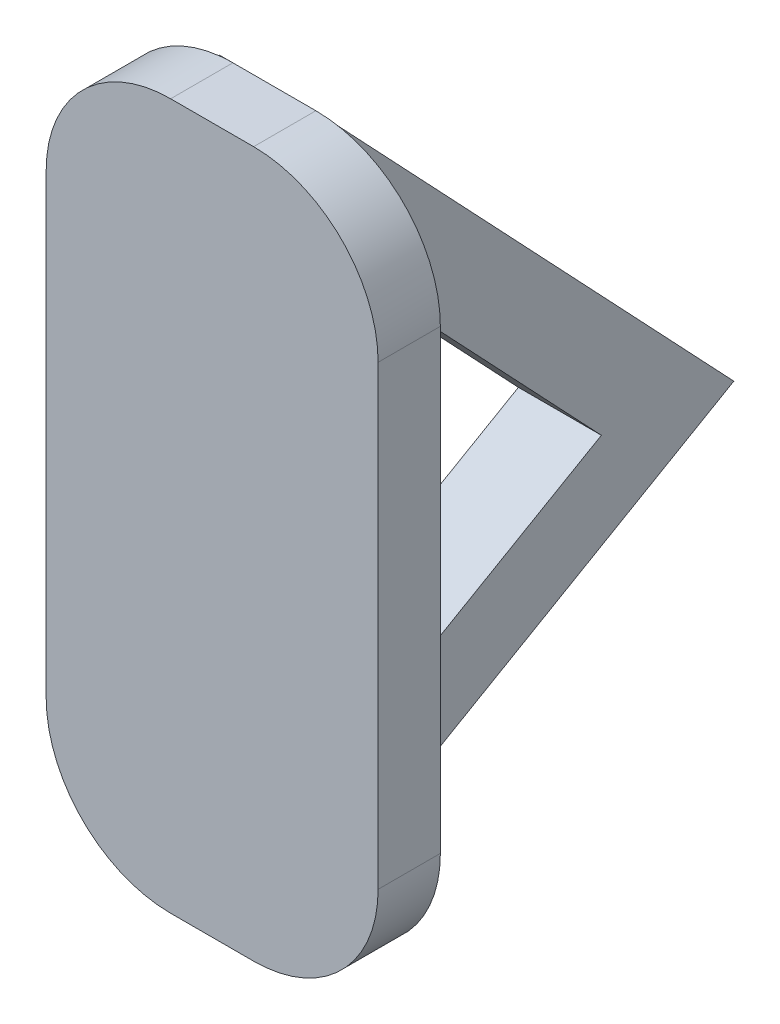
ISO-10303-21;
HEADER;
FILE_DESCRIPTION(('STEP AP214'),'2;1');
FILE_NAME('part.step','',(''),(''),'','','');
FILE_SCHEMA(('AUTOMOTIVE_DESIGN { 1 0 10303 214 1 1 1 1 }'));
ENDSEC;
DATA;
#1=APPLICATION_CONTEXT('core data for automotive mechanical design processes');
#2=APPLICATION_PROTOCOL_DEFINITION('international standard','automotive_design',2000,#1);
#3=PRODUCT_CONTEXT('',#1,'mechanical');
#4=PRODUCT('Part','Part','',(#3));
#5=PRODUCT_RELATED_PRODUCT_CATEGORY('part','',(#4));
#6=PRODUCT_DEFINITION_FORMATION('','',#4);
#7=PRODUCT_DEFINITION_CONTEXT('part definition',#1,'design');
#8=PRODUCT_DEFINITION('design','',#6,#7);
#9=PRODUCT_DEFINITION_SHAPE('','',#8);
#10=(LENGTH_UNIT() NAMED_UNIT(*) SI_UNIT(.MILLI.,.METRE.));
#11=(NAMED_UNIT(*) PLANE_ANGLE_UNIT() SI_UNIT($,.RADIAN.));
#12=(NAMED_UNIT(*) SI_UNIT($,.STERADIAN.) SOLID_ANGLE_UNIT());
#13=UNCERTAINTY_MEASURE_WITH_UNIT(LENGTH_MEASURE(1.E-05),#10,'distance_accuracy_value','');
#14=(GEOMETRIC_REPRESENTATION_CONTEXT(3) GLOBAL_UNCERTAINTY_ASSIGNED_CONTEXT((#13)) GLOBAL_UNIT_ASSIGNED_CONTEXT((#10,
#11,#12)) REPRESENTATION_CONTEXT('',''));
#15=CARTESIAN_POINT('',(0.,0.,0.));
#16=DIRECTION('',(0.,0.,1.));
#17=DIRECTION('',(1.,0.,0.));
#18=AXIS2_PLACEMENT_3D('',#15,#16,#17);
#19=CARTESIAN_POINT('',(1.,-5.5,0.));
#20=DIRECTION('',(0.,0.,1.));
#21=DIRECTION('',(1.,0.,0.));
#22=AXIS2_PLACEMENT_3D('',#19,#20,#21);
#23=PLANE('',#22);
#24=DIRECTION('',(0.,-1.,0.));
#25=VECTOR('',#24,1.);
#26=CARTESIAN_POINT('',(0.680224752622943,8.5,0.));
#27=LINE('',#26,#25);
#28=CARTESIAN_POINT('',(0.680224752622943,8.5,0.));
#29=VERTEX_POINT('',#28);
#30=CARTESIAN_POINT('',(0.680224752622943,-8.5,0.));
#31=VERTEX_POINT('',#30);
#32=EDGE_CURVE('E179',#29,#31,#27,.T.);
#33=ORIENTED_EDGE('',*,*,#32,.F.);
#34=DIRECTION('',(-1.,0.,0.));
#35=VECTOR('',#34,1.);
#36=CARTESIAN_POINT('',(-1.,8.5,0.));
#37=LINE('',#36,#35);
#38=CARTESIAN_POINT('',(0.999999999999999,8.5,0.));
#39=VERTEX_POINT('',#38);
#40=EDGE_CURVE('E217',#39,#29,#37,.T.);
#41=ORIENTED_EDGE('',*,*,#40,.F.);
#42=CARTESIAN_POINT('',(0.999999999999999,5.5,0.));
#43=DIRECTION('',(0.,0.,1.));
#44=DIRECTION('',(1.,0.,0.));
#45=AXIS2_PLACEMENT_3D('',#42,#43,#44);
#46=CIRCLE('',#45,3.);
#47=CARTESIAN_POINT('',(4.,5.5,0.));
#48=VERTEX_POINT('',#47);
#49=EDGE_CURVE('E215',#48,#39,#46,.T.);
#50=ORIENTED_EDGE('',*,*,#49,.F.);
#51=DIRECTION('',(0.,1.,0.));
#52=VECTOR('',#51,1.);
#53=CARTESIAN_POINT('',(4.,5.5,0.));
#54=LINE('',#53,#52);
#55=CARTESIAN_POINT('',(4.,-5.5,0.));
#56=VERTEX_POINT('',#55);
#57=EDGE_CURVE('E213',#56,#48,#54,.T.);
#58=ORIENTED_EDGE('',*,*,#57,.F.);
#59=CARTESIAN_POINT('',(1.,-5.5,0.));
#60=DIRECTION('',(0.,0.,1.));
#61=DIRECTION('',(1.,0.,0.));
#62=AXIS2_PLACEMENT_3D('',#59,#60,#61);
#63=CIRCLE('',#62,3.);
#64=CARTESIAN_POINT('',(1.,-8.5,0.));
#65=VERTEX_POINT('',#64);
#66=EDGE_CURVE('E191',#65,#56,#63,.T.);
#67=ORIENTED_EDGE('',*,*,#66,.F.);
#68=DIRECTION('',(1.,0.,0.));
#69=VECTOR('',#68,1.);
#70=CARTESIAN_POINT('',(-1.,-8.5,0.));
#71=LINE('',#70,#69);
#72=EDGE_CURVE('E196',#31,#65,#71,.T.);
#73=ORIENTED_EDGE('',*,*,#72,.F.);
#74=EDGE_LOOP('',(#33,#41,#50,#58,#67,#73));
#75=FACE_BOUND('',#74,.T.);
#76=ADVANCED_FACE('F36',(#75),#23,.F.);
#77=DIRECTION('',(0.,1.,0.));
#78=VECTOR('',#77,1.);
#79=CARTESIAN_POINT('',(-1.31977524737705,8.5,0.));
#80=LINE('',#79,#78);
#81=CARTESIAN_POINT('',(-1.31977524737706,-8.48290861260699,0.));
#82=VERTEX_POINT('',#81);
#83=CARTESIAN_POINT('',(-1.31977524737705,8.48290861260699,0.));
#84=VERTEX_POINT('',#83);
#85=EDGE_CURVE('E189',#82,#84,#80,.T.);
#86=ORIENTED_EDGE('',*,*,#85,.F.);
#87=CARTESIAN_POINT('',(-1.,-5.5,0.));
#88=DIRECTION('',(0.,0.,1.));
#89=DIRECTION('',(-1.,0.,0.));
#90=AXIS2_PLACEMENT_3D('',#87,#88,#89);
#91=CIRCLE('',#90,3.);
#92=CARTESIAN_POINT('',(-4.,-5.5,0.));
#93=VERTEX_POINT('',#92);
#94=EDGE_CURVE('E226',#93,#82,#91,.T.);
#95=ORIENTED_EDGE('',*,*,#94,.F.);
#96=DIRECTION('',(0.,-1.,0.));
#97=VECTOR('',#96,1.);
#98=CARTESIAN_POINT('',(-4.,5.5,0.));
#99=LINE('',#98,#97);
#100=CARTESIAN_POINT('',(-4.,5.5,0.));
#101=VERTEX_POINT('',#100);
#102=EDGE_CURVE('E223',#101,#93,#99,.T.);
#103=ORIENTED_EDGE('',*,*,#102,.F.);
#104=CARTESIAN_POINT('',(-1.,5.5,0.));
#105=DIRECTION('',(0.,0.,1.));
#106=DIRECTION('',(1.,0.,0.));
#107=AXIS2_PLACEMENT_3D('',#104,#105,#106);
#108=CIRCLE('',#107,3.);
#109=EDGE_CURVE('E220',#84,#101,#108,.T.);
#110=ORIENTED_EDGE('',*,*,#109,.F.);
#111=EDGE_LOOP('',(#86,#95,#103,#110));
#112=FACE_BOUND('',#111,.T.);
#113=ADVANCED_FACE('F275',(#112),#23,.F.);
#114=CARTESIAN_POINT('',(1.,-5.5,1.5));
#115=DIRECTION('',(0.,0.,-1.));
#116=DIRECTION('',(-1.,0.,0.));
#117=AXIS2_PLACEMENT_3D('',#114,#115,#116);
#118=CYLINDRICAL_SURFACE('',#117,3.);
#119=ORIENTED_EDGE('',*,*,#66,.T.);
#120=DIRECTION('',(0.,0.,-1.));
#121=VECTOR('',#120,1.);
#122=CARTESIAN_POINT('',(4.,-5.5,1.5));
#123=LINE('',#122,#121);
#124=CARTESIAN_POINT('',(4.,-5.5,1.5));
#125=VERTEX_POINT('',#124);
#126=EDGE_CURVE('E250',#125,#56,#123,.T.);
#127=ORIENTED_EDGE('',*,*,#126,.F.);
#128=CARTESIAN_POINT('',(1.,-5.5,1.5));
#129=DIRECTION('',(0.,0.,1.));
#130=DIRECTION('',(1.,0.,0.));
#131=AXIS2_PLACEMENT_3D('',#128,#129,#130);
#132=CIRCLE('',#131,3.);
#133=CARTESIAN_POINT('',(1.,-8.5,1.5));
#134=VERTEX_POINT('',#133);
#135=EDGE_CURVE('E192',#134,#125,#132,.T.);
#136=ORIENTED_EDGE('',*,*,#135,.F.);
#137=DIRECTION('',(0.,0.,-1.));
#138=VECTOR('',#137,1.);
#139=CARTESIAN_POINT('',(1.,-8.5,1.5));
#140=LINE('',#139,#138);
#141=EDGE_CURVE('E210',#134,#65,#140,.T.);
#142=ORIENTED_EDGE('',*,*,#141,.T.);
#143=EDGE_LOOP('',(#119,#127,#136,#142));
#144=FACE_BOUND('',#143,.T.);
#145=ADVANCED_FACE('F38',(#144),#118,.T.);
#146=CARTESIAN_POINT('',(4.,5.5,1.5));
#147=DIRECTION('',(-1.,0.,0.));
#148=DIRECTION('',(0.,0.,1.));
#149=AXIS2_PLACEMENT_3D('',#146,#147,#148);
#150=PLANE('',#149);
#151=ORIENTED_EDGE('',*,*,#57,.T.);
#152=DIRECTION('',(0.,0.,-1.));
#153=VECTOR('',#152,1.);
#154=CARTESIAN_POINT('',(4.,5.5,1.5));
#155=LINE('',#154,#153);
#156=CARTESIAN_POINT('',(4.,5.5,1.5));
#157=VERTEX_POINT('',#156);
#158=EDGE_CURVE('E247',#157,#48,#155,.T.);
#159=ORIENTED_EDGE('',*,*,#158,.F.);
#160=DIRECTION('',(0.,1.,0.));
#161=VECTOR('',#160,1.);
#162=CARTESIAN_POINT('',(4.,5.5,1.5));
#163=LINE('',#162,#161);
#164=EDGE_CURVE('E195',#125,#157,#163,.T.);
#165=ORIENTED_EDGE('',*,*,#164,.F.);
#166=ORIENTED_EDGE('',*,*,#126,.T.);
#167=EDGE_LOOP('',(#151,#159,#165,#166));
#168=FACE_BOUND('',#167,.T.);
#169=ADVANCED_FACE('F309',(#168),#150,.F.);
#170=CARTESIAN_POINT('',(0.999999999999999,5.5,1.5));
#171=DIRECTION('',(0.,0.,-1.));
#172=DIRECTION('',(-1.,0.,0.));
#173=AXIS2_PLACEMENT_3D('',#170,#171,#172);
#174=CYLINDRICAL_SURFACE('',#173,3.);
#175=ORIENTED_EDGE('',*,*,#49,.T.);
#176=DIRECTION('',(0.,0.,-1.));
#177=VECTOR('',#176,1.);
#178=CARTESIAN_POINT('',(0.999999999999999,8.5,1.5));
#179=LINE('',#178,#177);
#180=CARTESIAN_POINT('',(0.999999999999999,8.5,1.5));
#181=VERTEX_POINT('',#180);
#182=EDGE_CURVE('E244',#181,#39,#179,.T.);
#183=ORIENTED_EDGE('',*,*,#182,.F.);
#184=CARTESIAN_POINT('',(0.999999999999999,5.5,1.5));
#185=DIRECTION('',(0.,0.,1.));
#186=DIRECTION('',(1.,0.,0.));
#187=AXIS2_PLACEMENT_3D('',#184,#185,#186);
#188=CIRCLE('',#187,3.);
#189=EDGE_CURVE('E198',#157,#181,#188,.T.);
#190=ORIENTED_EDGE('',*,*,#189,.F.);
#191=ORIENTED_EDGE('',*,*,#158,.T.);
#192=EDGE_LOOP('',(#175,#183,#190,#191));
#193=FACE_BOUND('',#192,.T.);
#194=ADVANCED_FACE('F306',(#193),#174,.T.);
#195=CARTESIAN_POINT('',(-1.,8.5,1.5));
#196=DIRECTION('',(0.,-1.,0.));
#197=DIRECTION('',(0.,0.,-1.));
#198=AXIS2_PLACEMENT_3D('',#195,#196,#197);
#199=PLANE('',#198);
#200=ORIENTED_EDGE('',*,*,#40,.T.);
#201=DIRECTION('',(1.,0.,0.));
#202=VECTOR('',#201,1.);
#203=CARTESIAN_POINT('',(-4.,8.5,0.));
#204=LINE('',#203,#202);
#205=CARTESIAN_POINT('',(-1.,8.5,0.));
#206=VERTEX_POINT('',#205);
#207=EDGE_CURVE('E169',#206,#29,#204,.T.);
#208=ORIENTED_EDGE('',*,*,#207,.F.);
#209=DIRECTION('',(0.,0.,-1.));
#210=VECTOR('',#209,1.);
#211=CARTESIAN_POINT('',(-1.,8.5,1.5));
#212=LINE('',#211,#210);
#213=CARTESIAN_POINT('',(-1.,8.5,1.5));
#214=VERTEX_POINT('',#213);
#215=EDGE_CURVE('E241',#214,#206,#212,.T.);
#216=ORIENTED_EDGE('',*,*,#215,.F.);
#217=DIRECTION('',(-1.,0.,0.));
#218=VECTOR('',#217,1.);
#219=CARTESIAN_POINT('',(-1.,8.5,1.5));
#220=LINE('',#219,#218);
#221=EDGE_CURVE('E200',#181,#214,#220,.T.);
#222=ORIENTED_EDGE('',*,*,#221,.F.);
#223=ORIENTED_EDGE('',*,*,#182,.T.);
#224=EDGE_LOOP('',(#200,#208,#216,#222,#223));
#225=FACE_BOUND('',#224,.T.);
#226=ADVANCED_FACE('F302',(#225),#199,.F.);
#227=CARTESIAN_POINT('',(-1.,5.5,1.5));
#228=DIRECTION('',(0.,0.,-1.));
#229=DIRECTION('',(-1.,0.,0.));
#230=AXIS2_PLACEMENT_3D('',#227,#228,#229);
#231=CYLINDRICAL_SURFACE('',#230,3.);
#232=EDGE_CURVE('E221',#206,#84,#108,.T.);
#233=ORIENTED_EDGE('',*,*,#232,.T.);
#234=ORIENTED_EDGE('',*,*,#109,.T.);
#235=DIRECTION('',(0.,0.,-1.));
#236=VECTOR('',#235,1.);
#237=CARTESIAN_POINT('',(-4.,5.5,1.5));
#238=LINE('',#237,#236);
#239=CARTESIAN_POINT('',(-4.,5.5,1.5));
#240=VERTEX_POINT('',#239);
#241=EDGE_CURVE('E238',#240,#101,#238,.T.);
#242=ORIENTED_EDGE('',*,*,#241,.F.);
#243=CARTESIAN_POINT('',(-1.,5.5,1.5));
#244=DIRECTION('',(0.,0.,1.));
#245=DIRECTION('',(1.,0.,0.));
#246=AXIS2_PLACEMENT_3D('',#243,#244,#245);
#247=CIRCLE('',#246,3.);
#248=EDGE_CURVE('E202',#214,#240,#247,.T.);
#249=ORIENTED_EDGE('',*,*,#248,.F.);
#250=ORIENTED_EDGE('',*,*,#215,.T.);
#251=EDGE_LOOP('',(#233,#234,#242,#249,#250));
#252=FACE_BOUND('',#251,.T.);
#253=ADVANCED_FACE('F298',(#252),#231,.T.);
#254=CARTESIAN_POINT('',(-4.,5.5,1.5));
#255=DIRECTION('',(1.,0.,0.));
#256=DIRECTION('',(0.,1.,0.));
#257=AXIS2_PLACEMENT_3D('',#254,#255,#256);
#258=PLANE('',#257);
#259=ORIENTED_EDGE('',*,*,#102,.T.);
#260=DIRECTION('',(0.,0.,-1.));
#261=VECTOR('',#260,1.);
#262=CARTESIAN_POINT('',(-4.,-5.5,1.5));
#263=LINE('',#262,#261);
#264=CARTESIAN_POINT('',(-4.,-5.5,1.5));
#265=VERTEX_POINT('',#264);
#266=EDGE_CURVE('E235',#265,#93,#263,.T.);
#267=ORIENTED_EDGE('',*,*,#266,.F.);
#268=DIRECTION('',(0.,-1.,0.));
#269=VECTOR('',#268,1.);
#270=CARTESIAN_POINT('',(-4.,5.5,1.5));
#271=LINE('',#270,#269);
#272=EDGE_CURVE('E204',#240,#265,#271,.T.);
#273=ORIENTED_EDGE('',*,*,#272,.F.);
#274=ORIENTED_EDGE('',*,*,#241,.T.);
#275=EDGE_LOOP('',(#259,#267,#273,#274));
#276=FACE_BOUND('',#275,.T.);
#277=ADVANCED_FACE('F294',(#276),#258,.F.);
#278=CARTESIAN_POINT('',(-1.,-5.5,1.5));
#279=DIRECTION('',(0.,0.,-1.));
#280=DIRECTION('',(-1.,0.,0.));
#281=AXIS2_PLACEMENT_3D('',#278,#279,#280);
#282=CYLINDRICAL_SURFACE('',#281,3.);
#283=ORIENTED_EDGE('',*,*,#94,.T.);
#284=CARTESIAN_POINT('',(-1.,-8.5,0.));
#285=VERTEX_POINT('',#284);
#286=EDGE_CURVE('E225',#82,#285,#91,.T.);
#287=ORIENTED_EDGE('',*,*,#286,.T.);
#288=DIRECTION('',(0.,0.,-1.));
#289=VECTOR('',#288,1.);
#290=CARTESIAN_POINT('',(-1.,-8.5,1.5));
#291=LINE('',#290,#289);
#292=CARTESIAN_POINT('',(-1.,-8.5,1.5));
#293=VERTEX_POINT('',#292);
#294=EDGE_CURVE('E232',#293,#285,#291,.T.);
#295=ORIENTED_EDGE('',*,*,#294,.F.);
#296=CARTESIAN_POINT('',(-1.,-5.5,1.5));
#297=DIRECTION('',(0.,0.,1.));
#298=DIRECTION('',(-1.,0.,0.));
#299=AXIS2_PLACEMENT_3D('',#296,#297,#298);
#300=CIRCLE('',#299,3.);
#301=EDGE_CURVE('E206',#265,#293,#300,.T.);
#302=ORIENTED_EDGE('',*,*,#301,.F.);
#303=ORIENTED_EDGE('',*,*,#266,.T.);
#304=EDGE_LOOP('',(#283,#287,#295,#302,#303));
#305=FACE_BOUND('',#304,.T.);
#306=ADVANCED_FACE('F290',(#305),#282,.T.);
#307=CARTESIAN_POINT('',(-1.,-8.5,1.5));
#308=DIRECTION('',(0.,1.,0.));
#309=DIRECTION('',(0.,0.,1.));
#310=AXIS2_PLACEMENT_3D('',#307,#308,#309);
#311=PLANE('',#310);
#312=ORIENTED_EDGE('',*,*,#294,.T.);
#313=DIRECTION('',(1.,0.,0.));
#314=VECTOR('',#313,1.);
#315=CARTESIAN_POINT('',(-4.,-8.5,0.));
#316=LINE('',#315,#314);
#317=EDGE_CURVE('E170',#285,#31,#316,.T.);
#318=ORIENTED_EDGE('',*,*,#317,.T.);
#319=ORIENTED_EDGE('',*,*,#72,.T.);
#320=ORIENTED_EDGE('',*,*,#141,.F.);
#321=DIRECTION('',(1.,0.,0.));
#322=VECTOR('',#321,1.);
#323=CARTESIAN_POINT('',(-1.,-8.5,1.5));
#324=LINE('',#323,#322);
#325=EDGE_CURVE('E208',#293,#134,#324,.T.);
#326=ORIENTED_EDGE('',*,*,#325,.F.);
#327=EDGE_LOOP('',(#312,#318,#319,#320,#326));
#328=FACE_BOUND('',#327,.T.);
#329=ADVANCED_FACE('F287',(#328),#311,.F.);
#330=CARTESIAN_POINT('',(1.,-5.5,1.5));
#331=DIRECTION('',(0.,0.,1.));
#332=DIRECTION('',(1.,0.,0.));
#333=AXIS2_PLACEMENT_3D('',#330,#331,#332);
#334=PLANE('',#333);
#335=ORIENTED_EDGE('',*,*,#135,.T.);
#336=ORIENTED_EDGE('',*,*,#164,.T.);
#337=ORIENTED_EDGE('',*,*,#189,.T.);
#338=ORIENTED_EDGE('',*,*,#221,.T.);
#339=ORIENTED_EDGE('',*,*,#248,.T.);
#340=ORIENTED_EDGE('',*,*,#272,.T.);
#341=ORIENTED_EDGE('',*,*,#301,.T.);
#342=ORIENTED_EDGE('',*,*,#325,.T.);
#343=EDGE_LOOP('',(#335,#336,#337,#338,#339,#340,#341,#342));
#344=FACE_BOUND('',#343,.T.);
#345=ADVANCED_FACE('F285',(#344),#334,.T.);
#346=CARTESIAN_POINT('',(0.,0.,0.));
#347=DIRECTION('',(0.,0.,-1.));
#348=DIRECTION('',(-1.,0.,0.));
#349=AXIS2_PLACEMENT_3D('',#346,#347,#348);
#350=PLANE('',#349);
#351=ORIENTED_EDGE('',*,*,#286,.F.);
#352=CARTESIAN_POINT('',(-1.31977524737706,-8.5,0.));
#353=VERTEX_POINT('',#352);
#354=EDGE_CURVE('E185',#353,#82,#80,.T.);
#355=ORIENTED_EDGE('',*,*,#354,.F.);
#356=DIRECTION('',(-1.,0.,0.));
#357=VECTOR('',#356,1.);
#358=CARTESIAN_POINT('',(0.680224752622943,-8.5,0.));
#359=LINE('',#358,#357);
#360=EDGE_CURVE('E182',#285,#353,#359,.T.);
#361=ORIENTED_EDGE('',*,*,#360,.F.);
#362=EDGE_LOOP('',(#351,#355,#361));
#363=FACE_BOUND('',#362,.T.);
#364=ADVANCED_FACE('F356',(#363),#350,.F.);
#365=CARTESIAN_POINT('',(0.680224752622943,8.5,-20.));
#366=DIRECTION('',(-1.,0.,0.));
#367=DIRECTION('',(0.,0.,1.));
#368=AXIS2_PLACEMENT_3D('',#365,#366,#367);
#369=PLANE('',#368);
#370=DIRECTION('',(0.,-1.,0.));
#371=VECTOR('',#370,1.);
#372=CARTESIAN_POINT('',(0.680224752622943,3.47075069695333,-2.));
#373=LINE('',#372,#371);
#374=CARTESIAN_POINT('',(0.680224752622943,3.47075069695333,-2.));
#375=VERTEX_POINT('',#374);
#376=CARTESIAN_POINT('',(0.680224752622943,-5.03589838486227,-2.));
#377=VERTEX_POINT('',#376);
#378=EDGE_CURVE('E153',#375,#377,#373,.T.);
#379=ORIENTED_EDGE('',*,*,#378,.F.);
#380=DIRECTION('',(0.,0.726900460500599,0.686742834344863));
#381=VECTOR('',#380,1.);
#382=CARTESIAN_POINT('',(0.680224752622943,-2.03355165010385,-7.20021708654017));
#383=LINE('',#382,#381);
#384=CARTESIAN_POINT('',(0.680224752622943,-2.03355165010385,-7.20021708654017));
#385=VERTEX_POINT('',#384);
#386=EDGE_CURVE('E51',#385,#375,#383,.T.);
#387=ORIENTED_EDGE('',*,*,#386,.F.);
#388=DIRECTION('',(0.,0.499999999999995,-0.866025403784441));
#389=VECTOR('',#388,1.);
#390=CARTESIAN_POINT('',(0.680224752622943,-5.03589838486227,-2.));
#391=LINE('',#390,#389);
#392=EDGE_CURVE('E146',#377,#385,#391,.T.);
#393=ORIENTED_EDGE('',*,*,#392,.F.);
#394=EDGE_LOOP('',(#379,#387,#393));
#395=FACE_BOUND('',#394,.T.);
#396=ORIENTED_EDGE('',*,*,#32,.T.);
#397=DIRECTION('',(0.,-0.499999999999995,0.866025403784441));
#398=VECTOR('',#397,1.);
#399=CARTESIAN_POINT('',(0.680224752622943,-8.5,0.));
#400=LINE('',#399,#398);
#401=CARTESIAN_POINT('',(0.680224752622943,-2.50000000000006,-10.3923048454133));
#402=VERTEX_POINT('',#401);
#403=EDGE_CURVE('E167',#402,#31,#400,.T.);
#404=ORIENTED_EDGE('',*,*,#403,.F.);
#405=DIRECTION('',(0.,-0.7269004605006,-0.686742834344863));
#406=VECTOR('',#405,1.);
#407=CARTESIAN_POINT('',(0.680224752622943,-2.50000000000006,-10.3923048454133));
#408=LINE('',#407,#406);
#409=EDGE_CURVE('E163',#29,#402,#408,.T.);
#410=ORIENTED_EDGE('',*,*,#409,.F.);
#411=EDGE_LOOP('',(#396,#404,#410));
#412=FACE_BOUND('',#411,.T.);
#413=ADVANCED_FACE('F157',(#395,#412),#369,.F.);
#414=CARTESIAN_POINT('',(-1.31977524737705,8.5,-20.));
#415=DIRECTION('',(1.,0.,0.));
#416=DIRECTION('',(0.,1.,0.));
#417=AXIS2_PLACEMENT_3D('',#414,#415,#416);
#418=PLANE('',#417);
#419=DIRECTION('',(0.,0.499999999999995,-0.866025403784441));
#420=VECTOR('',#419,1.);
#421=CARTESIAN_POINT('',(-1.31977524737705,6.14230484541313,-21.3612159321678));
#422=LINE('',#421,#420);
#423=CARTESIAN_POINT('',(-1.31977524737706,-5.03589838486227,-2.));
#424=VERTEX_POINT('',#423);
#425=CARTESIAN_POINT('',(-1.31977524737706,-2.03355165010385,-7.20021708654017));
#426=VERTEX_POINT('',#425);
#427=EDGE_CURVE('E44',#424,#426,#422,.T.);
#428=ORIENTED_EDGE('',*,*,#427,.T.);
#429=DIRECTION('',(0.,0.726900460500599,0.686742834344863));
#430=VECTOR('',#429,1.);
#431=CARTESIAN_POINT('',(-1.31977524737706,-2.85735931930509,-7.97851348947913));
#432=LINE('',#431,#430);
#433=CARTESIAN_POINT('',(-1.31977524737706,3.47075069695333,-2.));
#434=VERTEX_POINT('',#433);
#435=EDGE_CURVE('E11',#426,#434,#432,.T.);
#436=ORIENTED_EDGE('',*,*,#435,.T.);
#437=DIRECTION('',(0.,-1.,0.));
#438=VECTOR('',#437,1.);
#439=CARTESIAN_POINT('',(-1.31977524737705,8.5,-2.));
#440=LINE('',#439,#438);
#441=EDGE_CURVE('E256',#434,#424,#440,.T.);
#442=ORIENTED_EDGE('',*,*,#441,.T.);
#443=EDGE_LOOP('',(#428,#436,#442));
#444=FACE_BOUND('',#443,.T.);
#445=DIRECTION('',(0.,-0.7269004605006,-0.686742834344863));
#446=VECTOR('',#445,1.);
#447=CARTESIAN_POINT('',(-1.31977524737706,-1.48387365061536,-9.43231441048033));
#448=LINE('',#447,#446);
#449=CARTESIAN_POINT('',(-1.31977524737705,8.5,0.));
#450=VERTEX_POINT('',#449);
#451=CARTESIAN_POINT('',(-1.31977524737706,-2.50000000000006,-10.3923048454133));
#452=VERTEX_POINT('',#451);
#453=EDGE_CURVE('E173',#450,#452,#448,.T.);
#454=ORIENTED_EDGE('',*,*,#453,.T.);
#455=DIRECTION('',(0.,-0.499999999999995,0.866025403784442));
#456=VECTOR('',#455,1.);
#457=CARTESIAN_POINT('',(-1.31977524737705,4.41025403784425,-22.3612159321678));
#458=LINE('',#457,#456);
#459=EDGE_CURVE('E253',#452,#353,#458,.T.);
#460=ORIENTED_EDGE('',*,*,#459,.T.);
#461=ORIENTED_EDGE('',*,*,#354,.T.);
#462=ORIENTED_EDGE('',*,*,#85,.T.);
#463=EDGE_CURVE('E184',#84,#450,#80,.T.);
#464=ORIENTED_EDGE('',*,*,#463,.T.);
#465=EDGE_LOOP('',(#454,#460,#461,#462,#464));
#466=FACE_BOUND('',#465,.T.);
#467=ADVANCED_FACE('F258',(#444,#466),#418,.F.);
#468=ORIENTED_EDGE('',*,*,#232,.F.);
#469=DIRECTION('',(1.,0.,0.));
#470=VECTOR('',#469,1.);
#471=CARTESIAN_POINT('',(0.680224752622943,8.5,0.));
#472=LINE('',#471,#470);
#473=EDGE_CURVE('E188',#450,#206,#472,.T.);
#474=ORIENTED_EDGE('',*,*,#473,.F.);
#475=ORIENTED_EDGE('',*,*,#463,.F.);
#476=EDGE_LOOP('',(#468,#474,#475));
#477=FACE_BOUND('',#476,.T.);
#478=ADVANCED_FACE('F342',(#477),#350,.F.);
#479=CARTESIAN_POINT('',(-4.,-8.5,0.));
#480=DIRECTION('',(0.,0.866025403784442,0.499999999999995));
#481=DIRECTION('',(0.,-0.499999999999995,0.866025403784442));
#482=AXIS2_PLACEMENT_3D('',#479,#480,#481);
#483=PLANE('',#482);
#484=DIRECTION('',(1.,0.,0.));
#485=VECTOR('',#484,1.);
#486=CARTESIAN_POINT('',(-4.,-2.50000000000006,-10.3923048454133));
#487=LINE('',#486,#485);
#488=EDGE_CURVE('E174',#452,#402,#487,.T.);
#489=ORIENTED_EDGE('',*,*,#488,.T.);
#490=ORIENTED_EDGE('',*,*,#403,.T.);
#491=ORIENTED_EDGE('',*,*,#317,.F.);
#492=ORIENTED_EDGE('',*,*,#360,.T.);
#493=ORIENTED_EDGE('',*,*,#459,.F.);
#494=EDGE_LOOP('',(#489,#490,#491,#492,#493));
#495=FACE_BOUND('',#494,.T.);
#496=ADVANCED_FACE('F269',(#495),#483,.F.);
#497=CARTESIAN_POINT('',(-4.,-2.50000000000006,-10.3923048454133));
#498=DIRECTION('',(0.,-0.686742834344863,0.726900460500599));
#499=DIRECTION('',(0.,-0.7269004605006,-0.686742834344863));
#500=AXIS2_PLACEMENT_3D('',#497,#498,#499);
#501=PLANE('',#500);
#502=ORIENTED_EDGE('',*,*,#473,.T.);
#503=ORIENTED_EDGE('',*,*,#207,.T.);
#504=ORIENTED_EDGE('',*,*,#409,.T.);
#505=ORIENTED_EDGE('',*,*,#488,.F.);
#506=ORIENTED_EDGE('',*,*,#453,.F.);
#507=EDGE_LOOP('',(#502,#503,#504,#505,#506));
#508=FACE_BOUND('',#507,.T.);
#509=ADVANCED_FACE('F262',(#508),#501,.F.);
#510=CARTESIAN_POINT('',(-4.,-2.03355165010385,-7.20021708654017));
#511=DIRECTION('',(0.,0.686742834344863,-0.726900460500599));
#512=DIRECTION('',(0.,0.726900460500599,0.686742834344863));
#513=AXIS2_PLACEMENT_3D('',#510,#511,#512);
#514=PLANE('',#513);
#515=DIRECTION('',(1.,0.,0.));
#516=VECTOR('',#515,1.);
#517=CARTESIAN_POINT('',(-4.,-2.03355165010385,-7.20021708654017));
#518=LINE('',#517,#516);
#519=EDGE_CURVE('E149',#426,#385,#518,.T.);
#520=ORIENTED_EDGE('',*,*,#519,.T.);
#521=ORIENTED_EDGE('',*,*,#386,.T.);
#522=DIRECTION('',(1.,0.,0.));
#523=VECTOR('',#522,1.);
#524=CARTESIAN_POINT('',(-4.,3.47075069695333,-2.));
#525=LINE('',#524,#523);
#526=EDGE_CURVE('E150',#434,#375,#525,.T.);
#527=ORIENTED_EDGE('',*,*,#526,.F.);
#528=ORIENTED_EDGE('',*,*,#435,.F.);
#529=EDGE_LOOP('',(#520,#521,#527,#528));
#530=FACE_BOUND('',#529,.T.);
#531=ADVANCED_FACE('F260',(#530),#514,.F.);
#532=CARTESIAN_POINT('',(-4.,-5.03589838486227,-2.));
#533=DIRECTION('',(0.,-0.866025403784442,-0.499999999999995));
#534=DIRECTION('',(0.,0.499999999999995,-0.866025403784441));
#535=AXIS2_PLACEMENT_3D('',#532,#533,#534);
#536=PLANE('',#535);
#537=DIRECTION('',(1.,0.,0.));
#538=VECTOR('',#537,1.);
#539=CARTESIAN_POINT('',(-4.,-5.03589838486227,-2.));
#540=LINE('',#539,#538);
#541=EDGE_CURVE('E59',#424,#377,#540,.T.);
#542=ORIENTED_EDGE('',*,*,#541,.T.);
#543=ORIENTED_EDGE('',*,*,#392,.T.);
#544=ORIENTED_EDGE('',*,*,#519,.F.);
#545=ORIENTED_EDGE('',*,*,#427,.F.);
#546=EDGE_LOOP('',(#542,#543,#544,#545));
#547=FACE_BOUND('',#546,.T.);
#548=ADVANCED_FACE('F143',(#547),#536,.F.);
#549=CARTESIAN_POINT('',(-4.,3.47075069695333,-2.));
#550=DIRECTION('',(0.,0.,1.));
#551=DIRECTION('',(1.,0.,0.));
#552=AXIS2_PLACEMENT_3D('',#549,#550,#551);
#553=PLANE('',#552);
#554=ORIENTED_EDGE('',*,*,#526,.T.);
#555=ORIENTED_EDGE('',*,*,#378,.T.);
#556=ORIENTED_EDGE('',*,*,#541,.F.);
#557=ORIENTED_EDGE('',*,*,#441,.F.);
#558=EDGE_LOOP('',(#554,#555,#556,#557));
#559=FACE_BOUND('',#558,.T.);
#560=ADVANCED_FACE('F154',(#559),#553,.F.);
#561=CLOSED_SHELL('',(#76,#113,#145,#169,#194,#226,#253,#277,#306,#329,#345,#364,#413,#467,#478,
#496,#509,#531,#548,#560));
#562=MANIFOLD_SOLID_BREP('B2',#561);
#563=ADVANCED_BREP_SHAPE_REPRESENTATION('',(#18,#562),#14);
#564=SHAPE_DEFINITION_REPRESENTATION(#9,#563);
ENDSEC;
END-ISO-10303-21;
